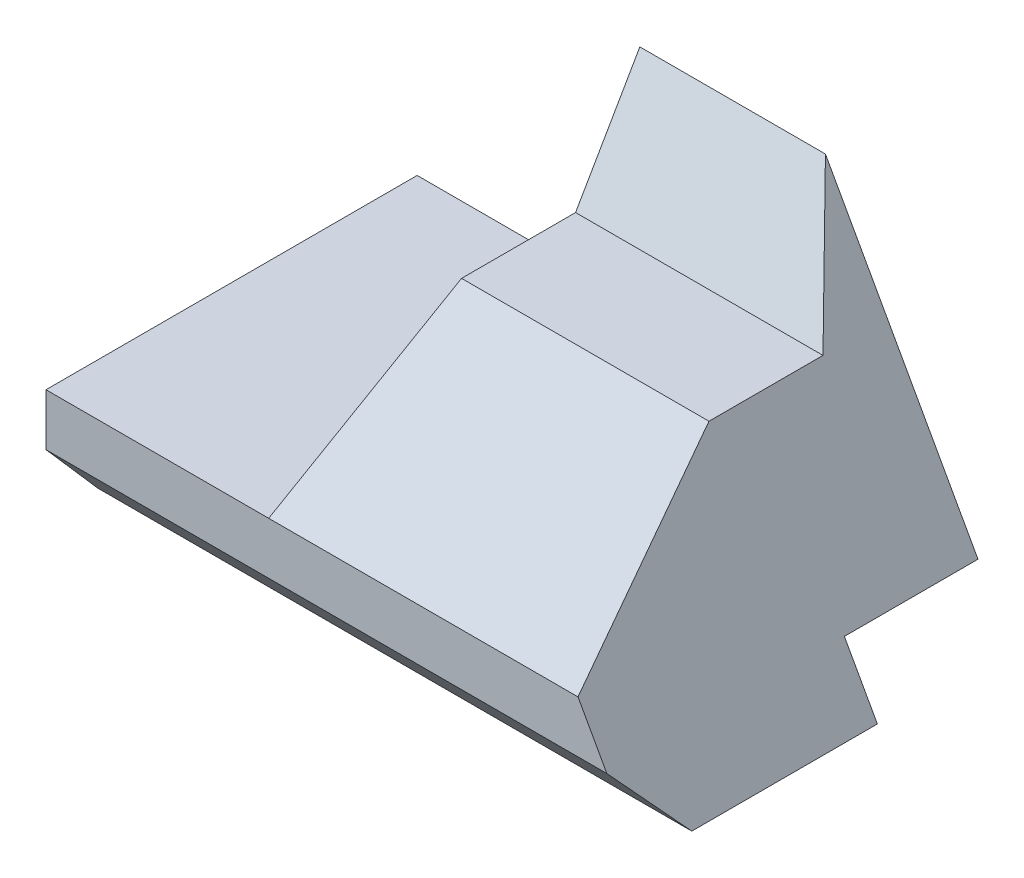
ISO-10303-21;
HEADER;
FILE_DESCRIPTION(('STEP AP214'),'2;1');
FILE_NAME('part.step','',(''),(''),'','','');
FILE_SCHEMA(('AUTOMOTIVE_DESIGN { 1 0 10303 214 1 1 1 1 }'));
ENDSEC;
DATA;
#1=APPLICATION_CONTEXT('core data for automotive mechanical design processes');
#2=APPLICATION_PROTOCOL_DEFINITION('international standard','automotive_design',2000,#1);
#3=PRODUCT_CONTEXT('',#1,'mechanical');
#4=PRODUCT('Part','Part','',(#3));
#5=PRODUCT_RELATED_PRODUCT_CATEGORY('part','',(#4));
#6=PRODUCT_DEFINITION_FORMATION('','',#4);
#7=PRODUCT_DEFINITION_CONTEXT('part definition',#1,'design');
#8=PRODUCT_DEFINITION('design','',#6,#7);
#9=PRODUCT_DEFINITION_SHAPE('','',#8);
#10=(LENGTH_UNIT() NAMED_UNIT(*) SI_UNIT(.MILLI.,.METRE.));
#11=(NAMED_UNIT(*) PLANE_ANGLE_UNIT() SI_UNIT($,.RADIAN.));
#12=(NAMED_UNIT(*) SI_UNIT($,.STERADIAN.) SOLID_ANGLE_UNIT());
#13=UNCERTAINTY_MEASURE_WITH_UNIT(LENGTH_MEASURE(1.E-05),#10,'distance_accuracy_value','');
#14=(GEOMETRIC_REPRESENTATION_CONTEXT(3) GLOBAL_UNCERTAINTY_ASSIGNED_CONTEXT((#13)) GLOBAL_UNIT_ASSIGNED_CONTEXT((#10,
#11,#12)) REPRESENTATION_CONTEXT('',''));
#15=CARTESIAN_POINT('',(0.,0.,0.));
#16=DIRECTION('',(0.,0.,1.));
#17=DIRECTION('',(1.,0.,0.));
#18=AXIS2_PLACEMENT_3D('',#15,#16,#17);
#19=CARTESIAN_POINT('',(40.,0.,0.));
#20=DIRECTION('',(0.,-0.500000000000001,-0.866025403784438));
#21=DIRECTION('',(0.,0.866025403784438,-0.500000000000001));
#22=AXIS2_PLACEMENT_3D('',#19,#20,#21);
#23=PLANE('',#22);
#24=DIRECTION('',(0.433554984762059,-0.780398972571708,0.450563556889584));
#25=VECTOR('',#24,1.);
#26=CARTESIAN_POINT('',(19.6992481203008,-8.4586466165413,4.88360190104005));
#27=LINE('',#26,#25);
#28=CARTESIAN_POINT('',(15.0000000000001,0.,0.));
#29=VERTEX_POINT('',#28);
#30=CARTESIAN_POINT('',(23.3333333333334,-15.,8.66025403784441));
#31=VERTEX_POINT('',#30);
#32=EDGE_CURVE('E220',#29,#31,#27,.T.);
#33=ORIENTED_EDGE('',*,*,#32,.F.);
#34=DIRECTION('',(-1.,0.,0.));
#35=VECTOR('',#34,1.);
#36=CARTESIAN_POINT('',(40.,0.,0.));
#37=LINE('',#36,#35);
#38=CARTESIAN_POINT('',(-10.,0.,0.));
#39=VERTEX_POINT('',#38);
#40=EDGE_CURVE('E127',#29,#39,#37,.T.);
#41=ORIENTED_EDGE('',*,*,#40,.T.);
#42=DIRECTION('',(0.,0.866025403784438,-0.500000000000001));
#43=VECTOR('',#42,1.);
#44=CARTESIAN_POINT('',(-10.,0.,0.));
#45=LINE('',#44,#43);
#46=CARTESIAN_POINT('',(-10.,-15.,8.66025403784441));
#47=VERTEX_POINT('',#46);
#48=EDGE_CURVE('E181',#47,#39,#45,.T.);
#49=ORIENTED_EDGE('',*,*,#48,.F.);
#50=DIRECTION('',(-1.,0.,0.));
#51=VECTOR('',#50,1.);
#52=CARTESIAN_POINT('',(40.,-15.,8.66025403784441));
#53=LINE('',#52,#51);
#54=EDGE_CURVE('E11',#31,#47,#53,.T.);
#55=ORIENTED_EDGE('',*,*,#54,.F.);
#56=EDGE_LOOP('',(#33,#41,#49,#55));
#57=FACE_BOUND('',#56,.T.);
#58=ADVANCED_FACE('F43',(#57),#23,.F.);
#59=CARTESIAN_POINT('',(40.,-15.,24.0192378864674));
#60=DIRECTION('',(0.,-1.,0.));
#61=DIRECTION('',(0.,0.,-1.));
#62=AXIS2_PLACEMENT_3D('',#59,#60,#61);
#63=PLANE('',#62);
#64=DIRECTION('',(0.,0.,1.));
#65=VECTOR('',#64,1.);
#66=CARTESIAN_POINT('',(23.3333333333334,-15.,24.0192378864674));
#67=LINE('',#66,#65);
#68=CARTESIAN_POINT('',(23.3333333333334,-15.,24.0192378864674));
#69=VERTEX_POINT('',#68);
#70=EDGE_CURVE('E228',#31,#69,#67,.T.);
#71=ORIENTED_EDGE('',*,*,#70,.F.);
#72=ORIENTED_EDGE('',*,*,#54,.T.);
#73=DIRECTION('',(0.,0.,-1.));
#74=VECTOR('',#73,1.);
#75=CARTESIAN_POINT('',(-10.,-15.,24.0192378864674));
#76=LINE('',#75,#74);
#77=CARTESIAN_POINT('',(-10.,-15.,24.0192378864674));
#78=VERTEX_POINT('',#77);
#79=EDGE_CURVE('E171',#78,#47,#76,.T.);
#80=ORIENTED_EDGE('',*,*,#79,.F.);
#81=DIRECTION('',(-1.,0.,0.));
#82=VECTOR('',#81,1.);
#83=CARTESIAN_POINT('',(40.,-15.,24.0192378864674));
#84=LINE('',#83,#82);
#85=EDGE_CURVE('E51',#69,#78,#84,.T.);
#86=ORIENTED_EDGE('',*,*,#85,.F.);
#87=EDGE_LOOP('',(#71,#72,#80,#86));
#88=FACE_BOUND('',#87,.T.);
#89=ADVANCED_FACE('F178',(#88),#63,.F.);
#90=CARTESIAN_POINT('',(40.,-30.,50.));
#91=DIRECTION('',(0.,-0.866025403784433,-0.500000000000009));
#92=DIRECTION('',(0.,0.500000000000009,-0.866025403784433));
#93=AXIS2_PLACEMENT_3D('',#90,#91,#92);
#94=PLANE('',#93);
#95=DIRECTION('',(0.267643863786098,-0.481758954814979,0.834430986740801));
#96=VECTOR('',#95,1.);
#97=CARTESIAN_POINT('',(32.2636103151863,-31.0744985673353,51.8610861112846));
#98=LINE('',#97,#96);
#99=CARTESIAN_POINT('',(31.6666666666667,-30.,49.9999999999999));
#100=VERTEX_POINT('',#99);
#101=EDGE_CURVE('E161',#69,#100,#98,.T.);
#102=ORIENTED_EDGE('',*,*,#101,.F.);
#103=ORIENTED_EDGE('',*,*,#85,.T.);
#104=DIRECTION('',(0.,0.500000000000009,-0.866025403784433));
#105=VECTOR('',#104,1.);
#106=CARTESIAN_POINT('',(-10.,-30.,50.));
#107=LINE('',#106,#105);
#108=CARTESIAN_POINT('',(-10.,-30.,49.9999999999999));
#109=VERTEX_POINT('',#108);
#110=EDGE_CURVE('E158',#109,#78,#107,.T.);
#111=ORIENTED_EDGE('',*,*,#110,.F.);
#112=DIRECTION('',(-1.,0.,0.));
#113=VECTOR('',#112,1.);
#114=CARTESIAN_POINT('',(40.,-30.,50.));
#115=LINE('',#114,#113);
#116=EDGE_CURVE('E142',#100,#109,#115,.T.);
#117=ORIENTED_EDGE('',*,*,#116,.F.);
#118=EDGE_LOOP('',(#102,#103,#111,#117));
#119=FACE_BOUND('',#118,.T.);
#120=ADVANCED_FACE('F155',(#119),#94,.F.);
#121=CARTESIAN_POINT('',(40.,0.,0.));
#122=DIRECTION('',(0.,0.,1.));
#123=DIRECTION('',(0.,-1.,0.));
#124=AXIS2_PLACEMENT_3D('',#121,#122,#123);
#125=PLANE('',#124);
#126=DIRECTION('',(-0.485642931178631,0.874157276121538,0.));
#127=VECTOR('',#126,1.);
#128=CARTESIAN_POINT('',(11.4622641509435,6.36792452830191,0.));
#129=LINE('',#128,#127);
#130=CARTESIAN_POINT('',(35.5555555555556,-37.,0.));
#131=VERTEX_POINT('',#130);
#132=EDGE_CURVE('E263',#131,#29,#129,.T.);
#133=ORIENTED_EDGE('',*,*,#132,.F.);
#134=DIRECTION('',(-1.,0.,0.));
#135=VECTOR('',#134,1.);
#136=CARTESIAN_POINT('',(40.,-37.,0.));
#137=LINE('',#136,#135);
#138=CARTESIAN_POINT('',(-40.,-37.,0.));
#139=VERTEX_POINT('',#138);
#140=EDGE_CURVE('E103',#131,#139,#137,.T.);
#141=ORIENTED_EDGE('',*,*,#140,.T.);
#142=DIRECTION('',(0.,1.,0.));
#143=VECTOR('',#142,1.);
#144=CARTESIAN_POINT('',(-40.,0.,0.));
#145=LINE('',#144,#143);
#146=CARTESIAN_POINT('',(-40.,-30.,0.));
#147=VERTEX_POINT('',#146);
#148=EDGE_CURVE('E117',#139,#147,#145,.T.);
#149=ORIENTED_EDGE('',*,*,#148,.T.);
#150=DIRECTION('',(1.,0.,0.));
#151=VECTOR('',#150,1.);
#152=CARTESIAN_POINT('',(0.,-30.,0.));
#153=LINE('',#152,#151);
#154=CARTESIAN_POINT('',(-10.,-30.,0.));
#155=VERTEX_POINT('',#154);
#156=EDGE_CURVE('E58',#147,#155,#153,.T.);
#157=ORIENTED_EDGE('',*,*,#156,.T.);
#158=DIRECTION('',(0.,-1.,0.));
#159=VECTOR('',#158,1.);
#160=CARTESIAN_POINT('',(-10.,0.,0.));
#161=LINE('',#160,#159);
#162=EDGE_CURVE('E219',#39,#155,#161,.T.);
#163=ORIENTED_EDGE('',*,*,#162,.F.);
#164=ORIENTED_EDGE('',*,*,#40,.F.);
#165=EDGE_LOOP('',(#133,#141,#149,#157,#163,#164));
#166=FACE_BOUND('',#165,.T.);
#167=ADVANCED_FACE('F243',(#166),#125,.F.);
#168=CARTESIAN_POINT('',(40.,-30.,50.));
#169=DIRECTION('',(0.,0.,-1.));
#170=DIRECTION('',(0.,1.,0.));
#171=AXIS2_PLACEMENT_3D('',#168,#169,#170);
#172=PLANE('',#171);
#173=DIRECTION('',(-0.485642931178631,0.874157276121538,0.));
#174=VECTOR('',#173,1.);
#175=CARTESIAN_POINT('',(11.4622641509435,6.36792452830191,49.9999999999999));
#176=LINE('',#175,#174);
#177=CARTESIAN_POINT('',(35.5555555555556,-37.0000000000001,49.9999999999999));
#178=VERTEX_POINT('',#177);
#179=EDGE_CURVE('E267',#178,#100,#176,.T.);
#180=ORIENTED_EDGE('',*,*,#179,.T.);
#181=ORIENTED_EDGE('',*,*,#116,.T.);
#182=DIRECTION('',(1.,0.,0.));
#183=VECTOR('',#182,1.);
#184=CARTESIAN_POINT('',(0.,-30.,49.9999999999999));
#185=LINE('',#184,#183);
#186=CARTESIAN_POINT('',(-40.,-30.,49.9999999999999));
#187=VERTEX_POINT('',#186);
#188=EDGE_CURVE('E215',#187,#109,#185,.T.);
#189=ORIENTED_EDGE('',*,*,#188,.F.);
#190=DIRECTION('',(0.,-1.,0.));
#191=VECTOR('',#190,1.);
#192=CARTESIAN_POINT('',(-40.,-30.,50.));
#193=LINE('',#192,#191);
#194=CARTESIAN_POINT('',(-40.,-37.,50.));
#195=VERTEX_POINT('',#194);
#196=EDGE_CURVE('E186',#187,#195,#193,.T.);
#197=ORIENTED_EDGE('',*,*,#196,.T.);
#198=DIRECTION('',(-1.,0.,0.));
#199=VECTOR('',#198,1.);
#200=CARTESIAN_POINT('',(40.,-37.,50.));
#201=LINE('',#200,#199);
#202=EDGE_CURVE('E139',#178,#195,#201,.T.);
#203=ORIENTED_EDGE('',*,*,#202,.F.);
#204=EDGE_LOOP('',(#180,#181,#189,#197,#203));
#205=FACE_BOUND('',#204,.T.);
#206=ADVANCED_FACE('F214',(#205),#172,.F.);
#207=CARTESIAN_POINT('',(40.,-45.,43.));
#208=DIRECTION('',(0.,0.658504607868518,-0.752576694706878));
#209=DIRECTION('',(0.,0.752576694706878,0.658504607868518));
#210=AXIS2_PLACEMENT_3D('',#207,#208,#209);
#211=PLANE('',#210);
#212=DIRECTION('',(0.385740437243928,-0.694332787039072,-0.607541188659187));
#213=VECTOR('',#212,1.);
#214=CARTESIAN_POINT('',(40.,-45.,43.));
#215=LINE('',#214,#213);
#216=CARTESIAN_POINT('',(40.,-45.,43.));
#217=VERTEX_POINT('',#216);
#218=EDGE_CURVE('E67',#178,#217,#215,.T.);
#219=ORIENTED_EDGE('',*,*,#218,.F.);
#220=ORIENTED_EDGE('',*,*,#202,.T.);
#221=DIRECTION('',(0.,-0.752576694706878,-0.658504607868518));
#222=VECTOR('',#221,1.);
#223=CARTESIAN_POINT('',(-40.,-45.,43.));
#224=LINE('',#223,#222);
#225=CARTESIAN_POINT('',(-40.,-45.,43.));
#226=VERTEX_POINT('',#225);
#227=EDGE_CURVE('E195',#195,#226,#224,.T.);
#228=ORIENTED_EDGE('',*,*,#227,.T.);
#229=DIRECTION('',(-1.,0.,0.));
#230=VECTOR('',#229,1.);
#231=CARTESIAN_POINT('',(40.,-45.,43.));
#232=LINE('',#231,#230);
#233=EDGE_CURVE('E135',#217,#226,#232,.T.);
#234=ORIENTED_EDGE('',*,*,#233,.F.);
#235=EDGE_LOOP('',(#219,#220,#228,#234));
#236=FACE_BOUND('',#235,.T.);
#237=ADVANCED_FACE('F208',(#236),#211,.F.);
#238=CARTESIAN_POINT('',(40.,-37.,18.));
#239=DIRECTION('',(0.,0.,1.));
#240=DIRECTION('',(1.,0.,0.));
#241=AXIS2_PLACEMENT_3D('',#238,#239,#240);
#242=PLANE('',#241);
#243=DIRECTION('',(-0.485642931178631,0.874157276121538,0.));
#244=VECTOR('',#243,1.);
#245=CARTESIAN_POINT('',(36.6037735849057,-38.8867924528302,18.));
#246=LINE('',#245,#244);
#247=CARTESIAN_POINT('',(40.,-45.,18.));
#248=VERTEX_POINT('',#247);
#249=CARTESIAN_POINT('',(35.5555555555556,-37.,18.));
#250=VERTEX_POINT('',#249);
#251=EDGE_CURVE('E403',#248,#250,#246,.T.);
#252=ORIENTED_EDGE('',*,*,#251,.F.);
#253=DIRECTION('',(-1.,0.,0.));
#254=VECTOR('',#253,1.);
#255=CARTESIAN_POINT('',(40.,-45.,18.));
#256=LINE('',#255,#254);
#257=CARTESIAN_POINT('',(-40.,-45.,18.));
#258=VERTEX_POINT('',#257);
#259=EDGE_CURVE('E102',#248,#258,#256,.T.);
#260=ORIENTED_EDGE('',*,*,#259,.T.);
#261=DIRECTION('',(0.,1.,0.));
#262=VECTOR('',#261,1.);
#263=CARTESIAN_POINT('',(-40.,-37.,18.));
#264=LINE('',#263,#262);
#265=CARTESIAN_POINT('',(-40.,-37.,18.));
#266=VERTEX_POINT('',#265);
#267=EDGE_CURVE('E107',#258,#266,#264,.T.);
#268=ORIENTED_EDGE('',*,*,#267,.T.);
#269=DIRECTION('',(-1.,0.,0.));
#270=VECTOR('',#269,1.);
#271=CARTESIAN_POINT('',(40.,-37.,18.));
#272=LINE('',#271,#270);
#273=EDGE_CURVE('E89',#250,#266,#272,.T.);
#274=ORIENTED_EDGE('',*,*,#273,.F.);
#275=EDGE_LOOP('',(#252,#260,#268,#274));
#276=FACE_BOUND('',#275,.T.);
#277=ADVANCED_FACE('F108',(#276),#242,.F.);
#278=CARTESIAN_POINT('',(40.,-37.,0.));
#279=DIRECTION('',(0.,1.,0.));
#280=DIRECTION('',(0.,0.,1.));
#281=AXIS2_PLACEMENT_3D('',#278,#279,#280);
#282=PLANE('',#281);
#283=DIRECTION('',(0.,0.,-1.));
#284=VECTOR('',#283,1.);
#285=CARTESIAN_POINT('',(35.5555555555556,-37.,0.));
#286=LINE('',#285,#284);
#287=EDGE_CURVE('E98',#250,#131,#286,.T.);
#288=ORIENTED_EDGE('',*,*,#287,.F.);
#289=ORIENTED_EDGE('',*,*,#273,.T.);
#290=DIRECTION('',(0.,0.,-1.));
#291=VECTOR('',#290,1.);
#292=CARTESIAN_POINT('',(-40.,-37.,0.));
#293=LINE('',#292,#291);
#294=EDGE_CURVE('E94',#266,#139,#293,.T.);
#295=ORIENTED_EDGE('',*,*,#294,.T.);
#296=ORIENTED_EDGE('',*,*,#140,.F.);
#297=EDGE_LOOP('',(#288,#289,#295,#296));
#298=FACE_BOUND('',#297,.T.);
#299=ADVANCED_FACE('F91',(#298),#282,.F.);
#300=CARTESIAN_POINT('',(40.,-45.,43.));
#301=DIRECTION('',(0.,1.,0.));
#302=DIRECTION('',(0.,0.,1.));
#303=AXIS2_PLACEMENT_3D('',#300,#301,#302);
#304=PLANE('',#303);
#305=DIRECTION('',(0.,0.,-1.));
#306=VECTOR('',#305,1.);
#307=CARTESIAN_POINT('',(-40.,-45.,43.));
#308=LINE('',#307,#306);
#309=EDGE_CURVE('E113',#226,#258,#308,.T.);
#310=ORIENTED_EDGE('',*,*,#309,.T.);
#311=ORIENTED_EDGE('',*,*,#259,.F.);
#312=DIRECTION('',(0.,0.,-1.));
#313=VECTOR('',#312,1.);
#314=CARTESIAN_POINT('',(40.,-45.,43.));
#315=LINE('',#314,#313);
#316=EDGE_CURVE('E123',#217,#248,#315,.T.);
#317=ORIENTED_EDGE('',*,*,#316,.F.);
#318=ORIENTED_EDGE('',*,*,#233,.T.);
#319=EDGE_LOOP('',(#310,#311,#317,#318));
#320=FACE_BOUND('',#319,.T.);
#321=ADVANCED_FACE('F201',(#320),#304,.F.);
#322=CARTESIAN_POINT('',(-40.,0.,0.));
#323=DIRECTION('',(-1.,0.,0.));
#324=DIRECTION('',(0.,0.,1.));
#325=AXIS2_PLACEMENT_3D('',#322,#323,#324);
#326=PLANE('',#325);
#327=DIRECTION('',(0.,0.,1.));
#328=VECTOR('',#327,1.);
#329=CARTESIAN_POINT('',(-40.,-30.,0.));
#330=LINE('',#329,#328);
#331=EDGE_CURVE('E233',#147,#187,#330,.T.);
#332=ORIENTED_EDGE('',*,*,#331,.F.);
#333=ORIENTED_EDGE('',*,*,#148,.F.);
#334=ORIENTED_EDGE('',*,*,#294,.F.);
#335=ORIENTED_EDGE('',*,*,#267,.F.);
#336=ORIENTED_EDGE('',*,*,#309,.F.);
#337=ORIENTED_EDGE('',*,*,#227,.F.);
#338=ORIENTED_EDGE('',*,*,#196,.F.);
#339=EDGE_LOOP('',(#332,#333,#334,#335,#336,#337,#338));
#340=FACE_BOUND('',#339,.T.);
#341=ADVANCED_FACE('F115',(#340),#326,.T.);
#342=CARTESIAN_POINT('',(-10.,0.,0.));
#343=DIRECTION('',(-1.,0.,0.));
#344=DIRECTION('',(0.,-1.,0.));
#345=AXIS2_PLACEMENT_3D('',#342,#343,#344);
#346=PLANE('',#345);
#347=ORIENTED_EDGE('',*,*,#48,.T.);
#348=ORIENTED_EDGE('',*,*,#162,.T.);
#349=DIRECTION('',(0.,0.,1.));
#350=VECTOR('',#349,1.);
#351=CARTESIAN_POINT('',(-10.,-30.,0.));
#352=LINE('',#351,#350);
#353=EDGE_CURVE('E174',#155,#109,#352,.T.);
#354=ORIENTED_EDGE('',*,*,#353,.T.);
#355=ORIENTED_EDGE('',*,*,#110,.T.);
#356=ORIENTED_EDGE('',*,*,#79,.T.);
#357=EDGE_LOOP('',(#347,#348,#354,#355,#356));
#358=FACE_BOUND('',#357,.T.);
#359=ADVANCED_FACE('F170',(#358),#346,.T.);
#360=CARTESIAN_POINT('',(0.,-30.,0.));
#361=DIRECTION('',(0.,-1.,0.));
#362=DIRECTION('',(0.,0.,-1.));
#363=AXIS2_PLACEMENT_3D('',#360,#361,#362);
#364=PLANE('',#363);
#365=ORIENTED_EDGE('',*,*,#188,.T.);
#366=ORIENTED_EDGE('',*,*,#353,.F.);
#367=ORIENTED_EDGE('',*,*,#156,.F.);
#368=ORIENTED_EDGE('',*,*,#331,.T.);
#369=EDGE_LOOP('',(#365,#366,#367,#368));
#370=FACE_BOUND('',#369,.T.);
#371=ADVANCED_FACE('F295',(#370),#364,.F.);
#372=CARTESIAN_POINT('',(11.4622641509435,6.36792452830191,0.));
#373=DIRECTION('',(0.874157276121538,0.485642931178631,0.));
#374=DIRECTION('',(-0.485642931178631,0.874157276121538,0.));
#375=AXIS2_PLACEMENT_3D('',#372,#373,#374);
#376=PLANE('',#375);
#377=ORIENTED_EDGE('',*,*,#32,.T.);
#378=ORIENTED_EDGE('',*,*,#70,.T.);
#379=ORIENTED_EDGE('',*,*,#101,.T.);
#380=ORIENTED_EDGE('',*,*,#179,.F.);
#381=ORIENTED_EDGE('',*,*,#218,.T.);
#382=ORIENTED_EDGE('',*,*,#316,.T.);
#383=ORIENTED_EDGE('',*,*,#251,.T.);
#384=ORIENTED_EDGE('',*,*,#287,.T.);
#385=ORIENTED_EDGE('',*,*,#132,.T.);
#386=EDGE_LOOP('',(#377,#378,#379,#380,#381,#382,#383,#384,#385));
#387=FACE_BOUND('',#386,.T.);
#388=ADVANCED_FACE('F265',(#387),#376,.T.);
#389=CLOSED_SHELL('',(#58,#89,#120,#167,#206,#237,#277,#299,#321,#341,#359,#371,#388));
#390=MANIFOLD_SOLID_BREP('B2',#389);
#391=ADVANCED_BREP_SHAPE_REPRESENTATION('',(#18,#390),#14);
#392=SHAPE_DEFINITION_REPRESENTATION(#9,#391);
ENDSEC;
END-ISO-10303-21;
